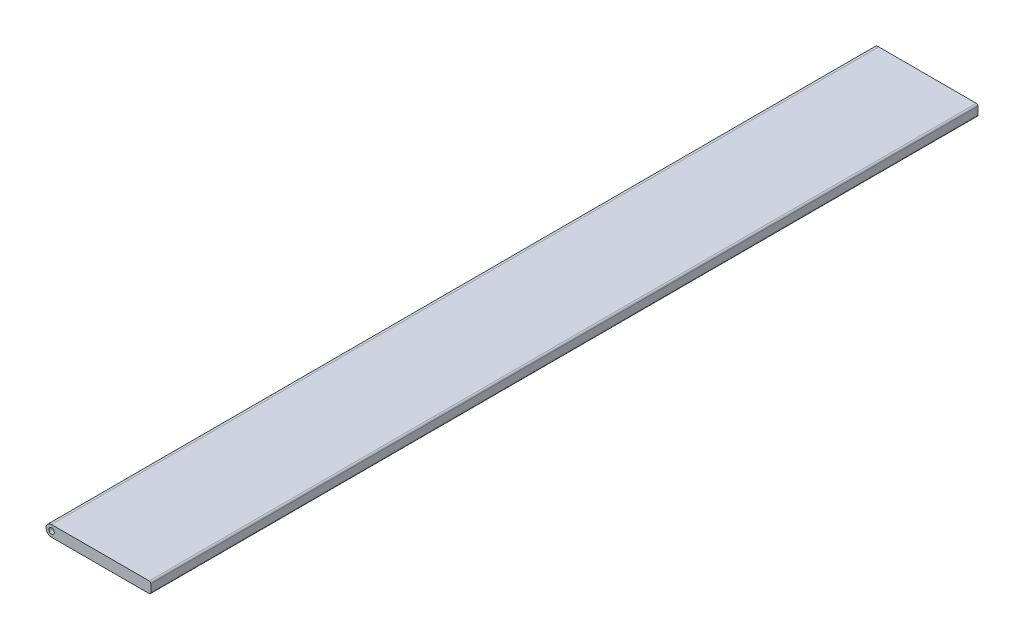
ISO-10303-21;
HEADER;
FILE_DESCRIPTION(('STEP AP214'),'2;1');
FILE_NAME('part.step','',(''),(''),'','','');
FILE_SCHEMA(('AUTOMOTIVE_DESIGN { 1 0 10303 214 1 1 1 1 }'));
ENDSEC;
DATA;
#1=APPLICATION_CONTEXT('core data for automotive mechanical design processes');
#2=APPLICATION_PROTOCOL_DEFINITION('international standard','automotive_design',2000,#1);
#3=PRODUCT_CONTEXT('',#1,'mechanical');
#4=PRODUCT('Part','Part','',(#3));
#5=PRODUCT_RELATED_PRODUCT_CATEGORY('part','',(#4));
#6=PRODUCT_DEFINITION_FORMATION('','',#4);
#7=PRODUCT_DEFINITION_CONTEXT('part definition',#1,'design');
#8=PRODUCT_DEFINITION('design','',#6,#7);
#9=PRODUCT_DEFINITION_SHAPE('','',#8);
#10=(LENGTH_UNIT() NAMED_UNIT(*) SI_UNIT(.MILLI.,.METRE.));
#11=(NAMED_UNIT(*) PLANE_ANGLE_UNIT() SI_UNIT($,.RADIAN.));
#12=(NAMED_UNIT(*) SI_UNIT($,.STERADIAN.) SOLID_ANGLE_UNIT());
#13=UNCERTAINTY_MEASURE_WITH_UNIT(LENGTH_MEASURE(1.E-05),#10,'distance_accuracy_value','');
#14=(GEOMETRIC_REPRESENTATION_CONTEXT(3) GLOBAL_UNCERTAINTY_ASSIGNED_CONTEXT((#13)) GLOBAL_UNIT_ASSIGNED_CONTEXT((#10,
#11,#12)) REPRESENTATION_CONTEXT('',''));
#15=CARTESIAN_POINT('',(0.,0.,0.));
#16=DIRECTION('',(0.,0.,1.));
#17=DIRECTION('',(1.,0.,0.));
#18=AXIS2_PLACEMENT_3D('',#15,#16,#17);
#19=CARTESIAN_POINT('',(0.,1.,150.));
#20=DIRECTION('',(0.,1.,0.));
#21=DIRECTION('',(0.,0.,1.));
#22=AXIS2_PLACEMENT_3D('',#19,#20,#21);
#23=PLANE('',#22);
#24=DIRECTION('',(1.,0.,0.));
#25=VECTOR('',#24,1.);
#26=CARTESIAN_POINT('',(0.,1.,150.));
#27=LINE('',#26,#25);
#28=CARTESIAN_POINT('',(0.,1.,150.));
#29=VERTEX_POINT('',#28);
#30=CARTESIAN_POINT('',(17.7,1.,150.));
#31=VERTEX_POINT('',#30);
#32=EDGE_CURVE('E92',#29,#31,#27,.T.);
#33=ORIENTED_EDGE('',*,*,#32,.T.);
#34=DIRECTION('',(0.,0.,-1.));
#35=VECTOR('',#34,1.);
#36=CARTESIAN_POINT('',(17.7,1.,150.));
#37=LINE('',#36,#35);
#38=CARTESIAN_POINT('',(17.7,1.,0.));
#39=VERTEX_POINT('',#38);
#40=EDGE_CURVE('E11',#31,#39,#37,.T.);
#41=ORIENTED_EDGE('',*,*,#40,.T.);
#42=DIRECTION('',(1.,0.,0.));
#43=VECTOR('',#42,1.);
#44=CARTESIAN_POINT('',(0.,1.,0.));
#45=LINE('',#44,#43);
#46=CARTESIAN_POINT('',(0.,1.,0.));
#47=VERTEX_POINT('',#46);
#48=EDGE_CURVE('E95',#47,#39,#45,.T.);
#49=ORIENTED_EDGE('',*,*,#48,.F.);
#50=DIRECTION('',(0.,0.,-1.));
#51=VECTOR('',#50,1.);
#52=CARTESIAN_POINT('',(0.,1.,150.));
#53=LINE('',#52,#51);
#54=EDGE_CURVE('E90',#29,#47,#53,.T.);
#55=ORIENTED_EDGE('',*,*,#54,.F.);
#56=EDGE_LOOP('',(#33,#41,#49,#55));
#57=FACE_BOUND('',#56,.T.);
#58=ADVANCED_FACE('F34',(#57),#23,.T.);
#59=CARTESIAN_POINT('',(0.,0.,150.));
#60=DIRECTION('',(0.,0.,-1.));
#61=DIRECTION('',(-1.,0.,0.));
#62=AXIS2_PLACEMENT_3D('',#59,#60,#61);
#63=CYLINDRICAL_SURFACE('',#62,1.);
#64=CARTESIAN_POINT('',(0.,0.,0.));
#65=DIRECTION('',(0.,0.,1.));
#66=DIRECTION('',(1.,0.,0.));
#67=AXIS2_PLACEMENT_3D('',#64,#65,#66);
#68=CIRCLE('',#67,1.);
#69=CARTESIAN_POINT('',(0.,-1.,0.));
#70=VERTEX_POINT('',#69);
#71=EDGE_CURVE('E123',#47,#70,#68,.T.);
#72=ORIENTED_EDGE('',*,*,#71,.T.);
#73=DIRECTION('',(0.,0.,-1.));
#74=VECTOR('',#73,1.);
#75=CARTESIAN_POINT('',(0.,-1.,150.));
#76=LINE('',#75,#74);
#77=CARTESIAN_POINT('',(0.,-1.,150.));
#78=VERTEX_POINT('',#77);
#79=EDGE_CURVE('E99',#78,#70,#76,.T.);
#80=ORIENTED_EDGE('',*,*,#79,.F.);
#81=CARTESIAN_POINT('',(0.,0.,150.));
#82=DIRECTION('',(0.,0.,1.));
#83=DIRECTION('',(1.,0.,0.));
#84=AXIS2_PLACEMENT_3D('',#81,#82,#83);
#85=CIRCLE('',#84,1.);
#86=EDGE_CURVE('E102',#29,#78,#85,.T.);
#87=ORIENTED_EDGE('',*,*,#86,.F.);
#88=ORIENTED_EDGE('',*,*,#54,.T.);
#89=EDGE_LOOP('',(#72,#80,#87,#88));
#90=FACE_BOUND('',#89,.T.);
#91=ADVANCED_FACE('F103',(#90),#63,.T.);
#92=CARTESIAN_POINT('',(0.,-1.,150.));
#93=DIRECTION('',(0.,1.,0.));
#94=DIRECTION('',(0.,0.,1.));
#95=AXIS2_PLACEMENT_3D('',#92,#93,#94);
#96=PLANE('',#95);
#97=DIRECTION('',(1.,0.,0.));
#98=VECTOR('',#97,1.);
#99=CARTESIAN_POINT('',(0.,-1.,0.));
#100=LINE('',#99,#98);
#101=CARTESIAN_POINT('',(17.7,-1.,0.));
#102=VERTEX_POINT('',#101);
#103=EDGE_CURVE('E125',#70,#102,#100,.T.);
#104=ORIENTED_EDGE('',*,*,#103,.T.);
#105=DIRECTION('',(0.,0.,-1.));
#106=VECTOR('',#105,1.);
#107=CARTESIAN_POINT('',(17.7,-1.,150.));
#108=LINE('',#107,#106);
#109=CARTESIAN_POINT('',(17.7,-1.,150.));
#110=VERTEX_POINT('',#109);
#111=EDGE_CURVE('E57',#102,#110,#108,.F.);
#112=ORIENTED_EDGE('',*,*,#111,.T.);
#113=DIRECTION('',(1.,0.,0.));
#114=VECTOR('',#113,1.);
#115=CARTESIAN_POINT('',(0.,-1.,150.));
#116=LINE('',#115,#114);
#117=EDGE_CURVE('E105',#78,#110,#116,.T.);
#118=ORIENTED_EDGE('',*,*,#117,.F.);
#119=ORIENTED_EDGE('',*,*,#79,.T.);
#120=EDGE_LOOP('',(#104,#112,#118,#119));
#121=FACE_BOUND('',#120,.T.);
#122=ADVANCED_FACE('F151',(#121),#96,.F.);
#123=CARTESIAN_POINT('',(18.,0.,150.));
#124=DIRECTION('',(1.,0.,0.));
#125=DIRECTION('',(0.,0.,-1.));
#126=AXIS2_PLACEMENT_3D('',#123,#124,#125);
#127=PLANE('',#126);
#128=DIRECTION('',(0.,-1.,0.));
#129=VECTOR('',#128,1.);
#130=CARTESIAN_POINT('',(18.,0.,150.));
#131=LINE('',#130,#129);
#132=CARTESIAN_POINT('',(18.,0.7,150.));
#133=VERTEX_POINT('',#132);
#134=CARTESIAN_POINT('',(18.,-0.7,150.));
#135=VERTEX_POINT('',#134);
#136=EDGE_CURVE('E116',#133,#135,#131,.T.);
#137=ORIENTED_EDGE('',*,*,#136,.T.);
#138=DIRECTION('',(0.,0.,-1.));
#139=VECTOR('',#138,1.);
#140=CARTESIAN_POINT('',(18.,-0.7,0.));
#141=LINE('',#140,#139);
#142=CARTESIAN_POINT('',(18.,-0.7,0.));
#143=VERTEX_POINT('',#142);
#144=EDGE_CURVE('E131',#135,#143,#141,.T.);
#145=ORIENTED_EDGE('',*,*,#144,.T.);
#146=DIRECTION('',(0.,-1.,0.));
#147=VECTOR('',#146,1.);
#148=CARTESIAN_POINT('',(18.,0.,0.));
#149=LINE('',#148,#147);
#150=CARTESIAN_POINT('',(18.,0.7,0.));
#151=VERTEX_POINT('',#150);
#152=EDGE_CURVE('E112',#151,#143,#149,.T.);
#153=ORIENTED_EDGE('',*,*,#152,.F.);
#154=DIRECTION('',(0.,0.,-1.));
#155=VECTOR('',#154,1.);
#156=CARTESIAN_POINT('',(18.,0.7,150.));
#157=LINE('',#156,#155);
#158=EDGE_CURVE('E98',#151,#133,#157,.F.);
#159=ORIENTED_EDGE('',*,*,#158,.T.);
#160=EDGE_LOOP('',(#137,#145,#153,#159));
#161=FACE_BOUND('',#160,.T.);
#162=ADVANCED_FACE('F143',(#161),#127,.T.);
#163=CARTESIAN_POINT('',(0.,0.,150.));
#164=DIRECTION('',(0.,0.,-1.));
#165=DIRECTION('',(-1.,0.,0.));
#166=AXIS2_PLACEMENT_3D('',#163,#164,#165);
#167=CYLINDRICAL_SURFACE('',#166,0.5);
#168=CARTESIAN_POINT('',(0.,0.,150.));
#169=DIRECTION('',(0.,0.,1.));
#170=DIRECTION('',(1.,0.,0.));
#171=AXIS2_PLACEMENT_3D('',#168,#169,#170);
#172=CIRCLE('',#171,0.5);
#173=CARTESIAN_POINT('',(0.5,0.,150.));
#174=VERTEX_POINT('',#173);
#175=EDGE_CURVE('E119',#174,#174,#172,.T.);
#176=ORIENTED_EDGE('',*,*,#175,.T.);
#177=EDGE_LOOP('',(#176));
#178=FACE_BOUND('',#177,.T.);
#179=CARTESIAN_POINT('',(0.,0.,0.));
#180=DIRECTION('',(0.,0.,1.));
#181=DIRECTION('',(1.,0.,0.));
#182=AXIS2_PLACEMENT_3D('',#179,#180,#181);
#183=CIRCLE('',#182,0.5);
#184=CARTESIAN_POINT('',(0.5,0.,0.));
#185=VERTEX_POINT('',#184);
#186=EDGE_CURVE('E109',#185,#185,#183,.T.);
#187=ORIENTED_EDGE('',*,*,#186,.F.);
#188=EDGE_LOOP('',(#187));
#189=FACE_BOUND('',#188,.T.);
#190=ADVANCED_FACE('F158',(#178,#189),#167,.F.);
#191=CARTESIAN_POINT('',(0.,0.,150.));
#192=DIRECTION('',(0.,0.,1.));
#193=DIRECTION('',(1.,0.,0.));
#194=AXIS2_PLACEMENT_3D('',#191,#192,#193);
#195=PLANE('',#194);
#196=ORIENTED_EDGE('',*,*,#117,.T.);
#197=CARTESIAN_POINT('',(17.7,-0.7,150.));
#198=DIRECTION('',(0.,0.,1.));
#199=DIRECTION('',(1.,0.,0.));
#200=AXIS2_PLACEMENT_3D('',#197,#198,#199);
#201=CIRCLE('',#200,0.3);
#202=EDGE_CURVE('E42',#110,#135,#201,.T.);
#203=ORIENTED_EDGE('',*,*,#202,.T.);
#204=ORIENTED_EDGE('',*,*,#136,.F.);
#205=CARTESIAN_POINT('',(17.7,0.7,150.));
#206=DIRECTION('',(0.,0.,1.));
#207=DIRECTION('',(1.,0.,0.));
#208=AXIS2_PLACEMENT_3D('',#205,#206,#207);
#209=CIRCLE('',#208,0.3);
#210=EDGE_CURVE('E49',#133,#31,#209,.T.);
#211=ORIENTED_EDGE('',*,*,#210,.T.);
#212=ORIENTED_EDGE('',*,*,#32,.F.);
#213=ORIENTED_EDGE('',*,*,#86,.T.);
#214=EDGE_LOOP('',(#196,#203,#204,#211,#212,#213));
#215=FACE_BOUND('',#214,.T.);
#216=ORIENTED_EDGE('',*,*,#175,.F.);
#217=EDGE_LOOP('',(#216));
#218=FACE_BOUND('',#217,.T.);
#219=ADVANCED_FACE('F107',(#215,#218),#195,.T.);
#220=CARTESIAN_POINT('',(0.,0.,0.));
#221=DIRECTION('',(0.,0.,1.));
#222=DIRECTION('',(1.,0.,0.));
#223=AXIS2_PLACEMENT_3D('',#220,#221,#222);
#224=PLANE('',#223);
#225=ORIENTED_EDGE('',*,*,#152,.T.);
#226=CARTESIAN_POINT('',(17.7,-0.7,0.));
#227=DIRECTION('',(0.,0.,1.));
#228=DIRECTION('',(1.,0.,0.));
#229=AXIS2_PLACEMENT_3D('',#226,#227,#228);
#230=CIRCLE('',#229,0.3);
#231=EDGE_CURVE('E136',#143,#102,#230,.F.);
#232=ORIENTED_EDGE('',*,*,#231,.T.);
#233=ORIENTED_EDGE('',*,*,#103,.F.);
#234=ORIENTED_EDGE('',*,*,#71,.F.);
#235=ORIENTED_EDGE('',*,*,#48,.T.);
#236=CARTESIAN_POINT('',(17.7,0.7,0.));
#237=DIRECTION('',(0.,0.,1.));
#238=DIRECTION('',(1.,0.,0.));
#239=AXIS2_PLACEMENT_3D('',#236,#237,#238);
#240=CIRCLE('',#239,0.3);
#241=EDGE_CURVE('E134',#39,#151,#240,.F.);
#242=ORIENTED_EDGE('',*,*,#241,.T.);
#243=EDGE_LOOP('',(#225,#232,#233,#234,#235,#242));
#244=FACE_BOUND('',#243,.T.);
#245=ORIENTED_EDGE('',*,*,#186,.T.);
#246=EDGE_LOOP('',(#245));
#247=FACE_BOUND('',#246,.T.);
#248=ADVANCED_FACE('F149',(#244,#247),#224,.F.);
#249=CARTESIAN_POINT('',(17.7,-0.7,150.));
#250=DIRECTION('',(0.,0.,1.));
#251=DIRECTION('',(1.,0.,0.));
#252=AXIS2_PLACEMENT_3D('',#249,#250,#251);
#253=CYLINDRICAL_SURFACE('',#252,0.3);
#254=ORIENTED_EDGE('',*,*,#202,.F.);
#255=ORIENTED_EDGE('',*,*,#111,.F.);
#256=ORIENTED_EDGE('',*,*,#231,.F.);
#257=ORIENTED_EDGE('',*,*,#144,.F.);
#258=EDGE_LOOP('',(#254,#255,#256,#257));
#259=FACE_BOUND('',#258,.T.);
#260=ADVANCED_FACE('F146',(#259),#253,.T.);
#261=CARTESIAN_POINT('',(17.7,0.7,150.));
#262=DIRECTION('',(0.,0.,-1.));
#263=DIRECTION('',(-1.,0.,0.));
#264=AXIS2_PLACEMENT_3D('',#261,#262,#263);
#265=CYLINDRICAL_SURFACE('',#264,0.3);
#266=ORIENTED_EDGE('',*,*,#210,.F.);
#267=ORIENTED_EDGE('',*,*,#158,.F.);
#268=ORIENTED_EDGE('',*,*,#241,.F.);
#269=ORIENTED_EDGE('',*,*,#40,.F.);
#270=EDGE_LOOP('',(#266,#267,#268,#269));
#271=FACE_BOUND('',#270,.T.);
#272=ADVANCED_FACE('F36',(#271),#265,.T.);
#273=CLOSED_SHELL('',(#58,#91,#122,#162,#190,#219,#248,#260,#272));
#274=MANIFOLD_SOLID_BREP('B2',#273);
#275=ADVANCED_BREP_SHAPE_REPRESENTATION('',(#18,#274),#14);
#276=SHAPE_DEFINITION_REPRESENTATION(#9,#275);
ENDSEC;
END-ISO-10303-21;
